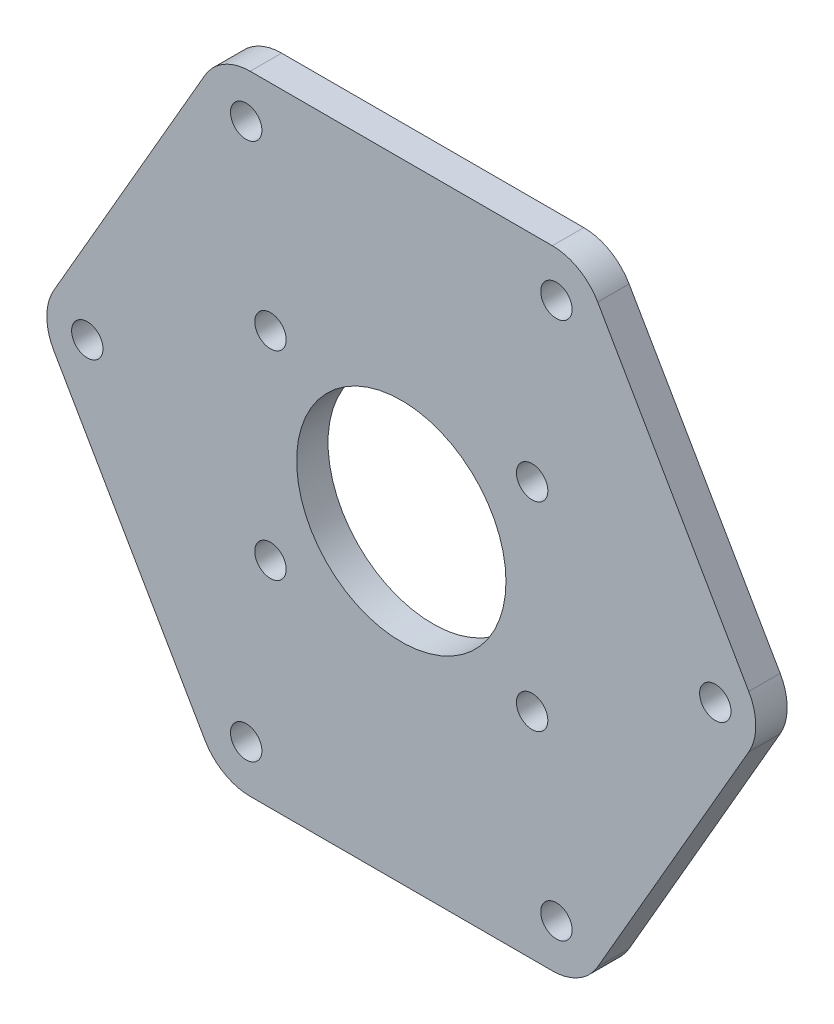
ISO-10303-21;
HEADER;
FILE_DESCRIPTION(('STEP AP214'),'2;1');
FILE_NAME('part.step','',(''),(''),'','','');
FILE_SCHEMA(('AUTOMOTIVE_DESIGN { 1 0 10303 214 1 1 1 1 }'));
ENDSEC;
DATA;
#1=APPLICATION_CONTEXT('core data for automotive mechanical design processes');
#2=APPLICATION_PROTOCOL_DEFINITION('international standard','automotive_design',2000,#1);
#3=PRODUCT_CONTEXT('',#1,'mechanical');
#4=PRODUCT('Part','Part','',(#3));
#5=PRODUCT_RELATED_PRODUCT_CATEGORY('part','',(#4));
#6=PRODUCT_DEFINITION_FORMATION('','',#4);
#7=PRODUCT_DEFINITION_CONTEXT('part definition',#1,'design');
#8=PRODUCT_DEFINITION('design','',#6,#7);
#9=PRODUCT_DEFINITION_SHAPE('','',#8);
#10=(LENGTH_UNIT() NAMED_UNIT(*) SI_UNIT(.MILLI.,.METRE.));
#11=(NAMED_UNIT(*) PLANE_ANGLE_UNIT() SI_UNIT($,.RADIAN.));
#12=(NAMED_UNIT(*) SI_UNIT($,.STERADIAN.) SOLID_ANGLE_UNIT());
#13=UNCERTAINTY_MEASURE_WITH_UNIT(LENGTH_MEASURE(1.E-05),#10,'distance_accuracy_value','');
#14=(GEOMETRIC_REPRESENTATION_CONTEXT(3) GLOBAL_UNCERTAINTY_ASSIGNED_CONTEXT((#13)) GLOBAL_UNIT_ASSIGNED_CONTEXT((#10,
#11,#12)) REPRESENTATION_CONTEXT('',''));
#15=CARTESIAN_POINT('',(0.,0.,0.));
#16=DIRECTION('',(0.,0.,1.));
#17=DIRECTION('',(1.,0.,0.));
#18=AXIS2_PLACEMENT_3D('',#15,#16,#17);
#19=CARTESIAN_POINT('',(17.3205080756888,-30.,3.));
#20=DIRECTION('',(-0.866025403784439,0.5,0.));
#21=DIRECTION('',(-0.5,-0.866025403784439,0.));
#22=AXIS2_PLACEMENT_3D('',#19,#20,#21);
#23=PLANE('',#22);
#24=DIRECTION('',(0.5,0.866025403784439,0.));
#25=VECTOR('',#24,1.);
#26=CARTESIAN_POINT('',(17.3205080756888,-30.,0.));
#27=LINE('',#26,#25);
#28=CARTESIAN_POINT('',(18.7638837486628,-27.5,0.));
#29=VERTEX_POINT('',#28);
#30=CARTESIAN_POINT('',(33.1976404784035,-2.5,0.));
#31=VERTEX_POINT('',#30);
#32=EDGE_CURVE('E152',#29,#31,#27,.T.);
#33=ORIENTED_EDGE('',*,*,#32,.T.);
#34=DIRECTION('',(0.,0.,-1.));
#35=VECTOR('',#34,1.);
#36=CARTESIAN_POINT('',(33.1976404784035,-2.49999999999999,3.));
#37=LINE('',#36,#35);
#38=CARTESIAN_POINT('',(33.1976404784035,-2.5,3.));
#39=VERTEX_POINT('',#38);
#40=EDGE_CURVE('E130',#31,#39,#37,.F.);
#41=ORIENTED_EDGE('',*,*,#40,.T.);
#42=DIRECTION('',(0.5,0.866025403784439,0.));
#43=VECTOR('',#42,1.);
#44=CARTESIAN_POINT('',(17.3205080756888,-30.,3.));
#45=LINE('',#44,#43);
#46=CARTESIAN_POINT('',(18.7638837486628,-27.5,3.));
#47=VERTEX_POINT('',#46);
#48=EDGE_CURVE('E168',#47,#39,#45,.T.);
#49=ORIENTED_EDGE('',*,*,#48,.F.);
#50=DIRECTION('',(0.,0.,-1.));
#51=VECTOR('',#50,1.);
#52=CARTESIAN_POINT('',(18.7638837486628,-27.5,3.));
#53=LINE('',#52,#51);
#54=EDGE_CURVE('E135',#47,#29,#53,.T.);
#55=ORIENTED_EDGE('',*,*,#54,.T.);
#56=EDGE_LOOP('',(#33,#41,#49,#55));
#57=FACE_BOUND('',#56,.T.);
#58=ADVANCED_FACE('F35',(#57),#23,.F.);
#59=CARTESIAN_POINT('',(34.6410161513775,0.,3.));
#60=DIRECTION('',(-0.866025403784438,-0.5,0.));
#61=DIRECTION('',(0.5,-0.866025403784439,0.));
#62=AXIS2_PLACEMENT_3D('',#59,#60,#61);
#63=PLANE('',#62);
#64=DIRECTION('',(-0.5,0.866025403784439,0.));
#65=VECTOR('',#64,1.);
#66=CARTESIAN_POINT('',(34.6410161513775,0.,3.));
#67=LINE('',#66,#65);
#68=CARTESIAN_POINT('',(33.1976404784035,2.5,3.));
#69=VERTEX_POINT('',#68);
#70=CARTESIAN_POINT('',(18.7638837486628,27.5,3.));
#71=VERTEX_POINT('',#70);
#72=EDGE_CURVE('E145',#69,#71,#67,.T.);
#73=ORIENTED_EDGE('',*,*,#72,.F.);
#74=DIRECTION('',(0.,0.,-1.));
#75=VECTOR('',#74,1.);
#76=CARTESIAN_POINT('',(33.1976404784035,2.50000000000001,3.));
#77=LINE('',#76,#75);
#78=CARTESIAN_POINT('',(33.1976404784035,2.5,0.));
#79=VERTEX_POINT('',#78);
#80=EDGE_CURVE('E129',#69,#79,#77,.T.);
#81=ORIENTED_EDGE('',*,*,#80,.T.);
#82=DIRECTION('',(-0.5,0.866025403784439,0.));
#83=VECTOR('',#82,1.);
#84=CARTESIAN_POINT('',(34.6410161513775,0.,0.));
#85=LINE('',#84,#83);
#86=CARTESIAN_POINT('',(18.7638837486628,27.5,0.));
#87=VERTEX_POINT('',#86);
#88=EDGE_CURVE('E142',#79,#87,#85,.T.);
#89=ORIENTED_EDGE('',*,*,#88,.T.);
#90=DIRECTION('',(0.,0.,-1.));
#91=VECTOR('',#90,1.);
#92=CARTESIAN_POINT('',(18.7638837486628,27.5,3.));
#93=LINE('',#92,#91);
#94=EDGE_CURVE('E147',#87,#71,#93,.F.);
#95=ORIENTED_EDGE('',*,*,#94,.T.);
#96=EDGE_LOOP('',(#73,#81,#89,#95));
#97=FACE_BOUND('',#96,.T.);
#98=ADVANCED_FACE('F141',(#97),#63,.F.);
#99=CARTESIAN_POINT('',(17.3205080756887,30.,3.));
#100=DIRECTION('',(0.,-1.,0.));
#101=DIRECTION('',(0.,0.,-1.));
#102=AXIS2_PLACEMENT_3D('',#99,#100,#101);
#103=PLANE('',#102);
#104=DIRECTION('',(-1.,0.,0.));
#105=VECTOR('',#104,1.);
#106=CARTESIAN_POINT('',(17.3205080756887,30.,3.));
#107=LINE('',#106,#105);
#108=CARTESIAN_POINT('',(14.4337567297406,30.,3.));
#109=VERTEX_POINT('',#108);
#110=CARTESIAN_POINT('',(-14.4337567297407,30.,3.));
#111=VERTEX_POINT('',#110);
#112=EDGE_CURVE('E228',#109,#111,#107,.T.);
#113=ORIENTED_EDGE('',*,*,#112,.F.);
#114=DIRECTION('',(0.,0.,-1.));
#115=VECTOR('',#114,1.);
#116=CARTESIAN_POINT('',(14.4337567297406,30.,3.));
#117=LINE('',#116,#115);
#118=CARTESIAN_POINT('',(14.4337567297406,30.,0.));
#119=VERTEX_POINT('',#118);
#120=EDGE_CURVE('E195',#109,#119,#117,.T.);
#121=ORIENTED_EDGE('',*,*,#120,.T.);
#122=DIRECTION('',(-1.,0.,0.));
#123=VECTOR('',#122,1.);
#124=CARTESIAN_POINT('',(17.3205080756887,30.,0.));
#125=LINE('',#124,#123);
#126=CARTESIAN_POINT('',(-14.4337567297407,30.,0.));
#127=VERTEX_POINT('',#126);
#128=EDGE_CURVE('E151',#119,#127,#125,.T.);
#129=ORIENTED_EDGE('',*,*,#128,.T.);
#130=DIRECTION('',(0.,0.,-1.));
#131=VECTOR('',#130,1.);
#132=CARTESIAN_POINT('',(-14.4337567297407,30.,3.));
#133=LINE('',#132,#131);
#134=EDGE_CURVE('E193',#127,#111,#133,.F.);
#135=ORIENTED_EDGE('',*,*,#134,.T.);
#136=EDGE_LOOP('',(#113,#121,#129,#135));
#137=FACE_BOUND('',#136,.T.);
#138=ADVANCED_FACE('F347',(#137),#103,.F.);
#139=CARTESIAN_POINT('',(-17.3205080756888,30.,3.));
#140=DIRECTION('',(0.866025403784439,-0.5,0.));
#141=DIRECTION('',(0.5,0.866025403784439,0.));
#142=AXIS2_PLACEMENT_3D('',#139,#140,#141);
#143=PLANE('',#142);
#144=DIRECTION('',(-0.5,-0.866025403784439,0.));
#145=VECTOR('',#144,1.);
#146=CARTESIAN_POINT('',(-17.3205080756888,30.,3.));
#147=LINE('',#146,#145);
#148=CARTESIAN_POINT('',(-18.7638837486629,27.5,3.));
#149=VERTEX_POINT('',#148);
#150=CARTESIAN_POINT('',(-33.1976404784035,2.5,3.));
#151=VERTEX_POINT('',#150);
#152=EDGE_CURVE('E223',#149,#151,#147,.T.);
#153=ORIENTED_EDGE('',*,*,#152,.F.);
#154=DIRECTION('',(0.,0.,-1.));
#155=VECTOR('',#154,1.);
#156=CARTESIAN_POINT('',(-18.7638837486629,27.5,3.));
#157=LINE('',#156,#155);
#158=CARTESIAN_POINT('',(-18.7638837486629,27.5,0.));
#159=VERTEX_POINT('',#158);
#160=EDGE_CURVE('E200',#149,#159,#157,.T.);
#161=ORIENTED_EDGE('',*,*,#160,.T.);
#162=DIRECTION('',(-0.5,-0.866025403784439,0.));
#163=VECTOR('',#162,1.);
#164=CARTESIAN_POINT('',(-17.3205080756888,30.,0.));
#165=LINE('',#164,#163);
#166=CARTESIAN_POINT('',(-33.1976404784035,2.5,0.));
#167=VERTEX_POINT('',#166);
#168=EDGE_CURVE('E155',#159,#167,#165,.T.);
#169=ORIENTED_EDGE('',*,*,#168,.T.);
#170=DIRECTION('',(0.,0.,-1.));
#171=VECTOR('',#170,1.);
#172=CARTESIAN_POINT('',(-33.1976404784035,2.5,3.));
#173=LINE('',#172,#171);
#174=EDGE_CURVE('E198',#167,#151,#173,.F.);
#175=ORIENTED_EDGE('',*,*,#174,.T.);
#176=EDGE_LOOP('',(#153,#161,#169,#175));
#177=FACE_BOUND('',#176,.T.);
#178=ADVANCED_FACE('F369',(#177),#143,.F.);
#179=CARTESIAN_POINT('',(-34.6410161513776,0.,3.));
#180=DIRECTION('',(0.866025403784438,0.5,0.));
#181=DIRECTION('',(-0.5,0.866025403784439,0.));
#182=AXIS2_PLACEMENT_3D('',#179,#180,#181);
#183=PLANE('',#182);
#184=DIRECTION('',(0.5,-0.866025403784439,0.));
#185=VECTOR('',#184,1.);
#186=CARTESIAN_POINT('',(-34.6410161513776,0.,3.));
#187=LINE('',#186,#185);
#188=CARTESIAN_POINT('',(-33.1976404784035,-2.5,3.));
#189=VERTEX_POINT('',#188);
#190=CARTESIAN_POINT('',(-18.7638837486629,-27.5,3.));
#191=VERTEX_POINT('',#190);
#192=EDGE_CURVE('E213',#189,#191,#187,.T.);
#193=ORIENTED_EDGE('',*,*,#192,.F.);
#194=DIRECTION('',(0.,0.,-1.));
#195=VECTOR('',#194,1.);
#196=CARTESIAN_POINT('',(-33.1976404784035,-2.5,3.));
#197=LINE('',#196,#195);
#198=CARTESIAN_POINT('',(-33.1976404784035,-2.5,0.));
#199=VERTEX_POINT('',#198);
#200=EDGE_CURVE('E205',#189,#199,#197,.T.);
#201=ORIENTED_EDGE('',*,*,#200,.T.);
#202=DIRECTION('',(0.5,-0.866025403784439,0.));
#203=VECTOR('',#202,1.);
#204=CARTESIAN_POINT('',(-34.6410161513776,0.,0.));
#205=LINE('',#204,#203);
#206=CARTESIAN_POINT('',(-18.7638837486629,-27.5,0.));
#207=VERTEX_POINT('',#206);
#208=EDGE_CURVE('E163',#199,#207,#205,.T.);
#209=ORIENTED_EDGE('',*,*,#208,.T.);
#210=DIRECTION('',(0.,0.,-1.));
#211=VECTOR('',#210,1.);
#212=CARTESIAN_POINT('',(-18.7638837486629,-27.5,3.));
#213=LINE('',#212,#211);
#214=EDGE_CURVE('E203',#207,#191,#213,.F.);
#215=ORIENTED_EDGE('',*,*,#214,.T.);
#216=EDGE_LOOP('',(#193,#201,#209,#215));
#217=FACE_BOUND('',#216,.T.);
#218=ADVANCED_FACE('F211',(#217),#183,.F.);
#219=CARTESIAN_POINT('',(-17.3205080756888,-30.,3.));
#220=DIRECTION('',(0.,1.,0.));
#221=DIRECTION('',(0.,0.,1.));
#222=AXIS2_PLACEMENT_3D('',#219,#220,#221);
#223=PLANE('',#222);
#224=DIRECTION('',(1.,0.,0.));
#225=VECTOR('',#224,1.);
#226=CARTESIAN_POINT('',(-17.3205080756888,-30.,3.));
#227=LINE('',#226,#225);
#228=CARTESIAN_POINT('',(-14.4337567297407,-30.,3.));
#229=VERTEX_POINT('',#228);
#230=CARTESIAN_POINT('',(14.4337567297406,-30.,3.));
#231=VERTEX_POINT('',#230);
#232=EDGE_CURVE('E169',#229,#231,#227,.T.);
#233=ORIENTED_EDGE('',*,*,#232,.F.);
#234=DIRECTION('',(0.,0.,-1.));
#235=VECTOR('',#234,1.);
#236=CARTESIAN_POINT('',(-14.4337567297407,-30.,3.));
#237=LINE('',#236,#235);
#238=CARTESIAN_POINT('',(-14.4337567297407,-30.,0.));
#239=VERTEX_POINT('',#238);
#240=EDGE_CURVE('E11',#229,#239,#237,.T.);
#241=ORIENTED_EDGE('',*,*,#240,.T.);
#242=DIRECTION('',(1.,0.,0.));
#243=VECTOR('',#242,1.);
#244=CARTESIAN_POINT('',(-17.3205080756888,-30.,0.));
#245=LINE('',#244,#243);
#246=CARTESIAN_POINT('',(14.4337567297406,-30.,0.));
#247=VERTEX_POINT('',#246);
#248=EDGE_CURVE('E166',#239,#247,#245,.T.);
#249=ORIENTED_EDGE('',*,*,#248,.T.);
#250=DIRECTION('',(0.,0.,-1.));
#251=VECTOR('',#250,1.);
#252=CARTESIAN_POINT('',(14.4337567297406,-30.,3.));
#253=LINE('',#252,#251);
#254=EDGE_CURVE('E43',#247,#231,#253,.F.);
#255=ORIENTED_EDGE('',*,*,#254,.T.);
#256=EDGE_LOOP('',(#233,#241,#249,#255));
#257=FACE_BOUND('',#256,.T.);
#258=ADVANCED_FACE('F221',(#257),#223,.F.);
#259=CARTESIAN_POINT('',(0.,0.,3.));
#260=DIRECTION('',(0.,0.,1.));
#261=DIRECTION('',(1.,0.,0.));
#262=AXIS2_PLACEMENT_3D('',#259,#260,#261);
#263=PLANE('',#262);
#264=CARTESIAN_POINT('',(-30.,0.,3.));
#265=DIRECTION('',(0.,0.,1.));
#266=DIRECTION('',(1.,0.,0.));
#267=AXIS2_PLACEMENT_3D('',#264,#265,#266);
#268=CIRCLE('',#267,1.5);
#269=CARTESIAN_POINT('',(-28.5,0.,3.));
#270=VERTEX_POINT('',#269);
#271=EDGE_CURVE('E277',#270,#270,#268,.T.);
#272=ORIENTED_EDGE('',*,*,#271,.F.);
#273=EDGE_LOOP('',(#272));
#274=FACE_BOUND('',#273,.T.);
#275=CARTESIAN_POINT('',(14.8205080756888,25.6698729810778,3.));
#276=DIRECTION('',(0.,0.,1.));
#277=DIRECTION('',(1.,0.,0.));
#278=AXIS2_PLACEMENT_3D('',#275,#276,#277);
#279=CIRCLE('',#278,1.5);
#280=CARTESIAN_POINT('',(16.3205080756888,25.6698729810778,3.));
#281=VERTEX_POINT('',#280);
#282=EDGE_CURVE('E290',#281,#281,#279,.T.);
#283=ORIENTED_EDGE('',*,*,#282,.F.);
#284=EDGE_LOOP('',(#283));
#285=FACE_BOUND('',#284,.T.);
#286=CARTESIAN_POINT('',(30.,0.,3.));
#287=DIRECTION('',(0.,0.,1.));
#288=DIRECTION('',(1.,0.,0.));
#289=AXIS2_PLACEMENT_3D('',#286,#287,#288);
#290=CIRCLE('',#289,1.5);
#291=CARTESIAN_POINT('',(31.5,0.,3.));
#292=VERTEX_POINT('',#291);
#293=EDGE_CURVE('E271',#292,#292,#290,.T.);
#294=ORIENTED_EDGE('',*,*,#293,.F.);
#295=EDGE_LOOP('',(#294));
#296=FACE_BOUND('',#295,.T.);
#297=CARTESIAN_POINT('',(-14.8205080756888,-25.6698729810778,3.));
#298=DIRECTION('',(0.,0.,1.));
#299=DIRECTION('',(1.,0.,0.));
#300=AXIS2_PLACEMENT_3D('',#297,#298,#299);
#301=CIRCLE('',#300,1.5);
#302=CARTESIAN_POINT('',(-13.3205080756888,-25.6698729810778,3.));
#303=VERTEX_POINT('',#302);
#304=EDGE_CURVE('E264',#303,#303,#301,.T.);
#305=ORIENTED_EDGE('',*,*,#304,.F.);
#306=EDGE_LOOP('',(#305));
#307=FACE_BOUND('',#306,.T.);
#308=CARTESIAN_POINT('',(14.8205080756888,-25.6698729810778,3.));
#309=DIRECTION('',(0.,0.,1.));
#310=DIRECTION('',(1.,0.,0.));
#311=AXIS2_PLACEMENT_3D('',#308,#309,#310);
#312=CIRCLE('',#311,1.5);
#313=CARTESIAN_POINT('',(16.3205080756888,-25.6698729810778,3.));
#314=VERTEX_POINT('',#313);
#315=EDGE_CURVE('E285',#314,#314,#312,.T.);
#316=ORIENTED_EDGE('',*,*,#315,.F.);
#317=EDGE_LOOP('',(#316));
#318=FACE_BOUND('',#317,.T.);
#319=CARTESIAN_POINT('',(-14.8205080756888,25.6698729810778,3.));
#320=DIRECTION('',(0.,0.,1.));
#321=DIRECTION('',(1.,0.,0.));
#322=AXIS2_PLACEMENT_3D('',#319,#320,#321);
#323=CIRCLE('',#322,1.5);
#324=CARTESIAN_POINT('',(-13.3205080756888,25.6698729810778,3.));
#325=VERTEX_POINT('',#324);
#326=EDGE_CURVE('E278',#325,#325,#323,.T.);
#327=ORIENTED_EDGE('',*,*,#326,.F.);
#328=EDGE_LOOP('',(#327));
#329=FACE_BOUND('',#328,.T.);
#330=CARTESIAN_POINT('',(12.5,-9.5,3.));
#331=DIRECTION('',(0.,0.,1.));
#332=DIRECTION('',(1.,0.,0.));
#333=AXIS2_PLACEMENT_3D('',#330,#331,#332);
#334=CIRCLE('',#333,1.5);
#335=CARTESIAN_POINT('',(14.,-9.5,3.));
#336=VERTEX_POINT('',#335);
#337=EDGE_CURVE('E240',#336,#336,#334,.T.);
#338=ORIENTED_EDGE('',*,*,#337,.F.);
#339=EDGE_LOOP('',(#338));
#340=FACE_BOUND('',#339,.T.);
#341=CARTESIAN_POINT('',(-12.5,-9.5,3.));
#342=DIRECTION('',(0.,0.,1.));
#343=DIRECTION('',(1.,0.,0.));
#344=AXIS2_PLACEMENT_3D('',#341,#342,#343);
#345=CIRCLE('',#344,1.5);
#346=CARTESIAN_POINT('',(-11.,-9.5,3.));
#347=VERTEX_POINT('',#346);
#348=EDGE_CURVE('E247',#347,#347,#345,.T.);
#349=ORIENTED_EDGE('',*,*,#348,.F.);
#350=EDGE_LOOP('',(#349));
#351=FACE_BOUND('',#350,.T.);
#352=CARTESIAN_POINT('',(12.5,9.5,3.));
#353=DIRECTION('',(0.,0.,1.));
#354=DIRECTION('',(1.,0.,0.));
#355=AXIS2_PLACEMENT_3D('',#352,#353,#354);
#356=CIRCLE('',#355,1.5);
#357=CARTESIAN_POINT('',(14.,9.5,3.));
#358=VERTEX_POINT('',#357);
#359=EDGE_CURVE('E253',#358,#358,#356,.T.);
#360=ORIENTED_EDGE('',*,*,#359,.F.);
#361=EDGE_LOOP('',(#360));
#362=FACE_BOUND('',#361,.T.);
#363=CARTESIAN_POINT('',(-12.5,9.5,3.));
#364=DIRECTION('',(0.,0.,1.));
#365=DIRECTION('',(1.,0.,0.));
#366=AXIS2_PLACEMENT_3D('',#363,#364,#365);
#367=CIRCLE('',#366,1.5);
#368=CARTESIAN_POINT('',(-11.,9.5,3.));
#369=VERTEX_POINT('',#368);
#370=EDGE_CURVE('E259',#369,#369,#367,.T.);
#371=ORIENTED_EDGE('',*,*,#370,.F.);
#372=EDGE_LOOP('',(#371));
#373=FACE_BOUND('',#372,.T.);
#374=CARTESIAN_POINT('',(0.,0.,3.));
#375=DIRECTION('',(0.,0.,1.));
#376=DIRECTION('',(1.,0.,0.));
#377=AXIS2_PLACEMENT_3D('',#374,#375,#376);
#378=CIRCLE('',#377,10.);
#379=CARTESIAN_POINT('',(10.,0.,3.));
#380=VERTEX_POINT('',#379);
#381=EDGE_CURVE('E234',#380,#380,#378,.T.);
#382=ORIENTED_EDGE('',*,*,#381,.F.);
#383=EDGE_LOOP('',(#382));
#384=FACE_BOUND('',#383,.T.);
#385=ORIENTED_EDGE('',*,*,#48,.T.);
#386=CARTESIAN_POINT('',(28.8675134594813,0.,3.));
#387=DIRECTION('',(0.,0.,1.));
#388=DIRECTION('',(1.,0.,0.));
#389=AXIS2_PLACEMENT_3D('',#386,#387,#388);
#390=CIRCLE('',#389,5.);
#391=EDGE_CURVE('E191',#39,#69,#390,.T.);
#392=ORIENTED_EDGE('',*,*,#391,.T.);
#393=ORIENTED_EDGE('',*,*,#72,.T.);
#394=CARTESIAN_POINT('',(14.4337567297406,25.,3.));
#395=DIRECTION('',(0.,0.,1.));
#396=DIRECTION('',(1.,0.,0.));
#397=AXIS2_PLACEMENT_3D('',#394,#395,#396);
#398=CIRCLE('',#397,5.);
#399=EDGE_CURVE('E189',#71,#109,#398,.T.);
#400=ORIENTED_EDGE('',*,*,#399,.T.);
#401=ORIENTED_EDGE('',*,*,#112,.T.);
#402=CARTESIAN_POINT('',(-14.4337567297407,25.,3.));
#403=DIRECTION('',(0.,0.,1.));
#404=DIRECTION('',(1.,0.,0.));
#405=AXIS2_PLACEMENT_3D('',#402,#403,#404);
#406=CIRCLE('',#405,5.);
#407=EDGE_CURVE('E187',#111,#149,#406,.T.);
#408=ORIENTED_EDGE('',*,*,#407,.T.);
#409=ORIENTED_EDGE('',*,*,#152,.T.);
#410=CARTESIAN_POINT('',(-28.8675134594813,0.,3.));
#411=DIRECTION('',(0.,0.,1.));
#412=DIRECTION('',(1.,0.,0.));
#413=AXIS2_PLACEMENT_3D('',#410,#411,#412);
#414=CIRCLE('',#413,5.);
#415=EDGE_CURVE('E185',#151,#189,#414,.T.);
#416=ORIENTED_EDGE('',*,*,#415,.T.);
#417=ORIENTED_EDGE('',*,*,#192,.T.);
#418=CARTESIAN_POINT('',(-14.4337567297407,-25.,3.));
#419=DIRECTION('',(0.,0.,1.));
#420=DIRECTION('',(1.,0.,0.));
#421=AXIS2_PLACEMENT_3D('',#418,#419,#420);
#422=CIRCLE('',#421,5.);
#423=EDGE_CURVE('E56',#191,#229,#422,.T.);
#424=ORIENTED_EDGE('',*,*,#423,.T.);
#425=ORIENTED_EDGE('',*,*,#232,.T.);
#426=CARTESIAN_POINT('',(14.4337567297406,-25.,3.));
#427=DIRECTION('',(0.,0.,1.));
#428=DIRECTION('',(1.,0.,0.));
#429=AXIS2_PLACEMENT_3D('',#426,#427,#428);
#430=CIRCLE('',#429,5.);
#431=EDGE_CURVE('E182',#231,#47,#430,.T.);
#432=ORIENTED_EDGE('',*,*,#431,.T.);
#433=EDGE_LOOP('',(#385,#392,#393,#400,#401,#408,#409,#416,#417,#424,#425,#432));
#434=FACE_BOUND('',#433,.T.);
#435=ADVANCED_FACE('F309',(#274,#285,#296,#307,#318,#329,#340,#351,#362,#373,#384,#434),#263,.T.);
#436=CARTESIAN_POINT('',(0.,0.,0.));
#437=DIRECTION('',(0.,0.,1.));
#438=DIRECTION('',(1.,0.,0.));
#439=AXIS2_PLACEMENT_3D('',#436,#437,#438);
#440=PLANE('',#439);
#441=CARTESIAN_POINT('',(-30.,0.,0.));
#442=DIRECTION('',(0.,0.,1.));
#443=DIRECTION('',(1.,0.,0.));
#444=AXIS2_PLACEMENT_3D('',#441,#442,#443);
#445=CIRCLE('',#444,1.5);
#446=CARTESIAN_POINT('',(-28.5,0.,0.));
#447=VERTEX_POINT('',#446);
#448=EDGE_CURVE('E244',#447,#447,#445,.T.);
#449=ORIENTED_EDGE('',*,*,#448,.T.);
#450=EDGE_LOOP('',(#449));
#451=FACE_BOUND('',#450,.T.);
#452=CARTESIAN_POINT('',(14.8205080756888,25.6698729810778,0.));
#453=DIRECTION('',(0.,0.,1.));
#454=DIRECTION('',(1.,0.,0.));
#455=AXIS2_PLACEMENT_3D('',#452,#453,#454);
#456=CIRCLE('',#455,1.5);
#457=CARTESIAN_POINT('',(16.3205080756888,25.6698729810778,0.));
#458=VERTEX_POINT('',#457);
#459=EDGE_CURVE('E282',#458,#458,#456,.T.);
#460=ORIENTED_EDGE('',*,*,#459,.T.);
#461=EDGE_LOOP('',(#460));
#462=FACE_BOUND('',#461,.T.);
#463=CARTESIAN_POINT('',(30.,0.,0.));
#464=DIRECTION('',(0.,0.,1.));
#465=DIRECTION('',(1.,0.,0.));
#466=AXIS2_PLACEMENT_3D('',#463,#464,#465);
#467=CIRCLE('',#466,1.5);
#468=CARTESIAN_POINT('',(31.5,0.,0.));
#469=VERTEX_POINT('',#468);
#470=EDGE_CURVE('E274',#469,#469,#467,.T.);
#471=ORIENTED_EDGE('',*,*,#470,.T.);
#472=EDGE_LOOP('',(#471));
#473=FACE_BOUND('',#472,.T.);
#474=CARTESIAN_POINT('',(-14.8205080756888,-25.6698729810778,0.));
#475=DIRECTION('',(0.,0.,1.));
#476=DIRECTION('',(1.,0.,0.));
#477=AXIS2_PLACEMENT_3D('',#474,#475,#476);
#478=CIRCLE('',#477,1.5);
#479=CARTESIAN_POINT('',(-13.3205080756888,-25.6698729810778,0.));
#480=VERTEX_POINT('',#479);
#481=EDGE_CURVE('E267',#480,#480,#478,.T.);
#482=ORIENTED_EDGE('',*,*,#481,.T.);
#483=EDGE_LOOP('',(#482));
#484=FACE_BOUND('',#483,.T.);
#485=CARTESIAN_POINT('',(14.8205080756888,-25.6698729810778,0.));
#486=DIRECTION('',(0.,0.,1.));
#487=DIRECTION('',(1.,0.,0.));
#488=AXIS2_PLACEMENT_3D('',#485,#486,#487);
#489=CIRCLE('',#488,1.5);
#490=CARTESIAN_POINT('',(16.3205080756888,-25.6698729810778,0.));
#491=VERTEX_POINT('',#490);
#492=EDGE_CURVE('E268',#491,#491,#489,.T.);
#493=ORIENTED_EDGE('',*,*,#492,.T.);
#494=EDGE_LOOP('',(#493));
#495=FACE_BOUND('',#494,.T.);
#496=CARTESIAN_POINT('',(-14.8205080756888,25.6698729810778,0.));
#497=DIRECTION('',(0.,0.,1.));
#498=DIRECTION('',(1.,0.,0.));
#499=AXIS2_PLACEMENT_3D('',#496,#497,#498);
#500=CIRCLE('',#499,1.5);
#501=CARTESIAN_POINT('',(-13.3205080756888,25.6698729810778,0.));
#502=VERTEX_POINT('',#501);
#503=EDGE_CURVE('E281',#502,#502,#500,.T.);
#504=ORIENTED_EDGE('',*,*,#503,.T.);
#505=EDGE_LOOP('',(#504));
#506=FACE_BOUND('',#505,.T.);
#507=CARTESIAN_POINT('',(12.5,-9.5,0.));
#508=DIRECTION('',(0.,0.,1.));
#509=DIRECTION('',(1.,0.,0.));
#510=AXIS2_PLACEMENT_3D('',#507,#508,#509);
#511=CIRCLE('',#510,1.5);
#512=CARTESIAN_POINT('',(14.,-9.5,0.));
#513=VERTEX_POINT('',#512);
#514=EDGE_CURVE('E243',#513,#513,#511,.T.);
#515=ORIENTED_EDGE('',*,*,#514,.T.);
#516=EDGE_LOOP('',(#515));
#517=FACE_BOUND('',#516,.T.);
#518=CARTESIAN_POINT('',(-12.5,-9.5,0.));
#519=DIRECTION('',(0.,0.,1.));
#520=DIRECTION('',(1.,0.,0.));
#521=AXIS2_PLACEMENT_3D('',#518,#519,#520);
#522=CIRCLE('',#521,1.5);
#523=CARTESIAN_POINT('',(-11.,-9.5,0.));
#524=VERTEX_POINT('',#523);
#525=EDGE_CURVE('E250',#524,#524,#522,.T.);
#526=ORIENTED_EDGE('',*,*,#525,.T.);
#527=EDGE_LOOP('',(#526));
#528=FACE_BOUND('',#527,.T.);
#529=CARTESIAN_POINT('',(12.5,9.5,0.));
#530=DIRECTION('',(0.,0.,1.));
#531=DIRECTION('',(1.,0.,0.));
#532=AXIS2_PLACEMENT_3D('',#529,#530,#531);
#533=CIRCLE('',#532,1.5);
#534=CARTESIAN_POINT('',(14.,9.5,0.));
#535=VERTEX_POINT('',#534);
#536=EDGE_CURVE('E256',#535,#535,#533,.T.);
#537=ORIENTED_EDGE('',*,*,#536,.T.);
#538=EDGE_LOOP('',(#537));
#539=FACE_BOUND('',#538,.T.);
#540=CARTESIAN_POINT('',(-12.5,9.5,0.));
#541=DIRECTION('',(0.,0.,1.));
#542=DIRECTION('',(1.,0.,0.));
#543=AXIS2_PLACEMENT_3D('',#540,#541,#542);
#544=CIRCLE('',#543,1.5);
#545=CARTESIAN_POINT('',(-11.,9.5,0.));
#546=VERTEX_POINT('',#545);
#547=EDGE_CURVE('E237',#546,#546,#544,.T.);
#548=ORIENTED_EDGE('',*,*,#547,.T.);
#549=EDGE_LOOP('',(#548));
#550=FACE_BOUND('',#549,.T.);
#551=CARTESIAN_POINT('',(0.,0.,0.));
#552=DIRECTION('',(0.,0.,1.));
#553=DIRECTION('',(1.,0.,0.));
#554=AXIS2_PLACEMENT_3D('',#551,#552,#553);
#555=CIRCLE('',#554,10.);
#556=CARTESIAN_POINT('',(10.,0.,0.));
#557=VERTEX_POINT('',#556);
#558=EDGE_CURVE('E157',#557,#557,#555,.T.);
#559=ORIENTED_EDGE('',*,*,#558,.T.);
#560=EDGE_LOOP('',(#559));
#561=FACE_BOUND('',#560,.T.);
#562=ORIENTED_EDGE('',*,*,#88,.F.);
#563=CARTESIAN_POINT('',(28.8675134594813,0.,0.));
#564=DIRECTION('',(0.,0.,1.));
#565=DIRECTION('',(1.,0.,0.));
#566=AXIS2_PLACEMENT_3D('',#563,#564,#565);
#567=CIRCLE('',#566,5.);
#568=EDGE_CURVE('E125',#79,#31,#567,.F.);
#569=ORIENTED_EDGE('',*,*,#568,.T.);
#570=ORIENTED_EDGE('',*,*,#32,.F.);
#571=CARTESIAN_POINT('',(14.4337567297406,-25.,0.));
#572=DIRECTION('',(0.,0.,1.));
#573=DIRECTION('',(1.,0.,0.));
#574=AXIS2_PLACEMENT_3D('',#571,#572,#573);
#575=CIRCLE('',#574,5.);
#576=EDGE_CURVE('E146',#29,#247,#575,.F.);
#577=ORIENTED_EDGE('',*,*,#576,.T.);
#578=ORIENTED_EDGE('',*,*,#248,.F.);
#579=CARTESIAN_POINT('',(-14.4337567297407,-25.,0.));
#580=DIRECTION('',(0.,0.,1.));
#581=DIRECTION('',(1.,0.,0.));
#582=AXIS2_PLACEMENT_3D('',#579,#580,#581);
#583=CIRCLE('',#582,5.);
#584=EDGE_CURVE('E172',#239,#207,#583,.F.);
#585=ORIENTED_EDGE('',*,*,#584,.T.);
#586=ORIENTED_EDGE('',*,*,#208,.F.);
#587=CARTESIAN_POINT('',(-28.8675134594813,0.,0.));
#588=DIRECTION('',(0.,0.,1.));
#589=DIRECTION('',(1.,0.,0.));
#590=AXIS2_PLACEMENT_3D('',#587,#588,#589);
#591=CIRCLE('',#590,5.);
#592=EDGE_CURVE('E174',#199,#167,#591,.F.);
#593=ORIENTED_EDGE('',*,*,#592,.T.);
#594=ORIENTED_EDGE('',*,*,#168,.F.);
#595=CARTESIAN_POINT('',(-14.4337567297407,25.,0.));
#596=DIRECTION('',(0.,0.,1.));
#597=DIRECTION('',(1.,0.,0.));
#598=AXIS2_PLACEMENT_3D('',#595,#596,#597);
#599=CIRCLE('',#598,5.);
#600=EDGE_CURVE('E176',#159,#127,#599,.F.);
#601=ORIENTED_EDGE('',*,*,#600,.T.);
#602=ORIENTED_EDGE('',*,*,#128,.F.);
#603=CARTESIAN_POINT('',(14.4337567297406,25.,0.));
#604=DIRECTION('',(0.,0.,1.));
#605=DIRECTION('',(1.,0.,0.));
#606=AXIS2_PLACEMENT_3D('',#603,#604,#605);
#607=CIRCLE('',#606,5.);
#608=EDGE_CURVE('E136',#119,#87,#607,.F.);
#609=ORIENTED_EDGE('',*,*,#608,.T.);
#610=EDGE_LOOP('',(#562,#569,#570,#577,#578,#585,#586,#593,#594,#601,#602,#609));
#611=FACE_BOUND('',#610,.T.);
#612=ADVANCED_FACE('F149',(#451,#462,#473,#484,#495,#506,#517,#528,#539,#550,#561,#611),#440,.F.);
#613=CARTESIAN_POINT('',(0.,0.,0.));
#614=DIRECTION('',(0.,0.,1.));
#615=DIRECTION('',(1.,0.,0.));
#616=AXIS2_PLACEMENT_3D('',#613,#614,#615);
#617=CYLINDRICAL_SURFACE('',#616,10.);
#618=ORIENTED_EDGE('',*,*,#558,.F.);
#619=EDGE_LOOP('',(#618));
#620=FACE_BOUND('',#619,.T.);
#621=ORIENTED_EDGE('',*,*,#381,.T.);
#622=EDGE_LOOP('',(#621));
#623=FACE_BOUND('',#622,.T.);
#624=ADVANCED_FACE('F386',(#620,#623),#617,.F.);
#625=CARTESIAN_POINT('',(-12.5,9.5,0.));
#626=DIRECTION('',(0.,0.,1.));
#627=DIRECTION('',(1.,0.,0.));
#628=AXIS2_PLACEMENT_3D('',#625,#626,#627);
#629=CYLINDRICAL_SURFACE('',#628,1.5);
#630=ORIENTED_EDGE('',*,*,#547,.F.);
#631=EDGE_LOOP('',(#630));
#632=FACE_BOUND('',#631,.T.);
#633=ORIENTED_EDGE('',*,*,#370,.T.);
#634=EDGE_LOOP('',(#633));
#635=FACE_BOUND('',#634,.T.);
#636=ADVANCED_FACE('F390',(#632,#635),#629,.F.);
#637=CARTESIAN_POINT('',(12.5,9.5,0.));
#638=DIRECTION('',(0.,0.,1.));
#639=DIRECTION('',(1.,0.,0.));
#640=AXIS2_PLACEMENT_3D('',#637,#638,#639);
#641=CYLINDRICAL_SURFACE('',#640,1.5);
#642=ORIENTED_EDGE('',*,*,#536,.F.);
#643=EDGE_LOOP('',(#642));
#644=FACE_BOUND('',#643,.T.);
#645=ORIENTED_EDGE('',*,*,#359,.T.);
#646=EDGE_LOOP('',(#645));
#647=FACE_BOUND('',#646,.T.);
#648=ADVANCED_FACE('F400',(#644,#647),#641,.F.);
#649=CARTESIAN_POINT('',(-12.5,-9.5,0.));
#650=DIRECTION('',(0.,0.,1.));
#651=DIRECTION('',(1.,0.,0.));
#652=AXIS2_PLACEMENT_3D('',#649,#650,#651);
#653=CYLINDRICAL_SURFACE('',#652,1.5);
#654=ORIENTED_EDGE('',*,*,#525,.F.);
#655=EDGE_LOOP('',(#654));
#656=FACE_BOUND('',#655,.T.);
#657=ORIENTED_EDGE('',*,*,#348,.T.);
#658=EDGE_LOOP('',(#657));
#659=FACE_BOUND('',#658,.T.);
#660=ADVANCED_FACE('F396',(#656,#659),#653,.F.);
#661=CARTESIAN_POINT('',(12.5,-9.5,0.));
#662=DIRECTION('',(0.,0.,1.));
#663=DIRECTION('',(1.,0.,0.));
#664=AXIS2_PLACEMENT_3D('',#661,#662,#663);
#665=CYLINDRICAL_SURFACE('',#664,1.5);
#666=ORIENTED_EDGE('',*,*,#514,.F.);
#667=EDGE_LOOP('',(#666));
#668=FACE_BOUND('',#667,.T.);
#669=ORIENTED_EDGE('',*,*,#337,.T.);
#670=EDGE_LOOP('',(#669));
#671=FACE_BOUND('',#670,.T.);
#672=ADVANCED_FACE('F392',(#668,#671),#665,.F.);
#673=CARTESIAN_POINT('',(-14.8205080756888,25.6698729810778,0.));
#674=DIRECTION('',(0.,0.,1.));
#675=DIRECTION('',(1.,0.,0.));
#676=AXIS2_PLACEMENT_3D('',#673,#674,#675);
#677=CYLINDRICAL_SURFACE('',#676,1.5);
#678=ORIENTED_EDGE('',*,*,#503,.F.);
#679=EDGE_LOOP('',(#678));
#680=FACE_BOUND('',#679,.T.);
#681=ORIENTED_EDGE('',*,*,#326,.T.);
#682=EDGE_LOOP('',(#681));
#683=FACE_BOUND('',#682,.T.);
#684=ADVANCED_FACE('F395',(#680,#683),#677,.F.);
#685=CARTESIAN_POINT('',(14.8205080756888,-25.6698729810778,0.));
#686=DIRECTION('',(0.,0.,1.));
#687=DIRECTION('',(1.,0.,0.));
#688=AXIS2_PLACEMENT_3D('',#685,#686,#687);
#689=CYLINDRICAL_SURFACE('',#688,1.5);
#690=ORIENTED_EDGE('',*,*,#492,.F.);
#691=EDGE_LOOP('',(#690));
#692=FACE_BOUND('',#691,.T.);
#693=ORIENTED_EDGE('',*,*,#315,.T.);
#694=EDGE_LOOP('',(#693));
#695=FACE_BOUND('',#694,.T.);
#696=ADVANCED_FACE('F412',(#692,#695),#689,.F.);
#697=CARTESIAN_POINT('',(-14.8205080756888,-25.6698729810778,0.));
#698=DIRECTION('',(0.,0.,1.));
#699=DIRECTION('',(1.,0.,0.));
#700=AXIS2_PLACEMENT_3D('',#697,#698,#699);
#701=CYLINDRICAL_SURFACE('',#700,1.5);
#702=ORIENTED_EDGE('',*,*,#481,.F.);
#703=EDGE_LOOP('',(#702));
#704=FACE_BOUND('',#703,.T.);
#705=ORIENTED_EDGE('',*,*,#304,.T.);
#706=EDGE_LOOP('',(#705));
#707=FACE_BOUND('',#706,.T.);
#708=ADVANCED_FACE('F408',(#704,#707),#701,.F.);
#709=CARTESIAN_POINT('',(30.,0.,0.));
#710=DIRECTION('',(0.,0.,1.));
#711=DIRECTION('',(1.,0.,0.));
#712=AXIS2_PLACEMENT_3D('',#709,#710,#711);
#713=CYLINDRICAL_SURFACE('',#712,1.5);
#714=ORIENTED_EDGE('',*,*,#470,.F.);
#715=EDGE_LOOP('',(#714));
#716=FACE_BOUND('',#715,.T.);
#717=ORIENTED_EDGE('',*,*,#293,.T.);
#718=EDGE_LOOP('',(#717));
#719=FACE_BOUND('',#718,.T.);
#720=ADVANCED_FACE('F411',(#716,#719),#713,.F.);
#721=CARTESIAN_POINT('',(14.8205080756888,25.6698729810778,0.));
#722=DIRECTION('',(0.,0.,1.));
#723=DIRECTION('',(1.,0.,0.));
#724=AXIS2_PLACEMENT_3D('',#721,#722,#723);
#725=CYLINDRICAL_SURFACE('',#724,1.5);
#726=ORIENTED_EDGE('',*,*,#459,.F.);
#727=EDGE_LOOP('',(#726));
#728=FACE_BOUND('',#727,.T.);
#729=ORIENTED_EDGE('',*,*,#282,.T.);
#730=EDGE_LOOP('',(#729));
#731=FACE_BOUND('',#730,.T.);
#732=ADVANCED_FACE('F305',(#728,#731),#725,.F.);
#733=CARTESIAN_POINT('',(-30.,0.,0.));
#734=DIRECTION('',(0.,0.,1.));
#735=DIRECTION('',(1.,0.,0.));
#736=AXIS2_PLACEMENT_3D('',#733,#734,#735);
#737=CYLINDRICAL_SURFACE('',#736,1.5);
#738=ORIENTED_EDGE('',*,*,#448,.F.);
#739=EDGE_LOOP('',(#738));
#740=FACE_BOUND('',#739,.T.);
#741=ORIENTED_EDGE('',*,*,#271,.T.);
#742=EDGE_LOOP('',(#741));
#743=FACE_BOUND('',#742,.T.);
#744=ADVANCED_FACE('F302',(#740,#743),#737,.F.);
#745=CARTESIAN_POINT('',(28.8675134594813,0.,3.));
#746=DIRECTION('',(0.,0.,-1.));
#747=DIRECTION('',(-1.,0.,0.));
#748=AXIS2_PLACEMENT_3D('',#745,#746,#747);
#749=CYLINDRICAL_SURFACE('',#748,5.);
#750=ORIENTED_EDGE('',*,*,#391,.F.);
#751=ORIENTED_EDGE('',*,*,#40,.F.);
#752=ORIENTED_EDGE('',*,*,#568,.F.);
#753=ORIENTED_EDGE('',*,*,#80,.F.);
#754=EDGE_LOOP('',(#750,#751,#752,#753));
#755=FACE_BOUND('',#754,.T.);
#756=ADVANCED_FACE('F128',(#755),#749,.T.);
#757=CARTESIAN_POINT('',(14.4337567297406,25.,3.));
#758=DIRECTION('',(0.,0.,-1.));
#759=DIRECTION('',(-1.,0.,0.));
#760=AXIS2_PLACEMENT_3D('',#757,#758,#759);
#761=CYLINDRICAL_SURFACE('',#760,5.);
#762=ORIENTED_EDGE('',*,*,#399,.F.);
#763=ORIENTED_EDGE('',*,*,#94,.F.);
#764=ORIENTED_EDGE('',*,*,#608,.F.);
#765=ORIENTED_EDGE('',*,*,#120,.F.);
#766=EDGE_LOOP('',(#762,#763,#764,#765));
#767=FACE_BOUND('',#766,.T.);
#768=ADVANCED_FACE('F353',(#767),#761,.T.);
#769=CARTESIAN_POINT('',(-14.4337567297407,25.,3.));
#770=DIRECTION('',(0.,0.,-1.));
#771=DIRECTION('',(-1.,0.,0.));
#772=AXIS2_PLACEMENT_3D('',#769,#770,#771);
#773=CYLINDRICAL_SURFACE('',#772,5.);
#774=ORIENTED_EDGE('',*,*,#407,.F.);
#775=ORIENTED_EDGE('',*,*,#134,.F.);
#776=ORIENTED_EDGE('',*,*,#600,.F.);
#777=ORIENTED_EDGE('',*,*,#160,.F.);
#778=EDGE_LOOP('',(#774,#775,#776,#777));
#779=FACE_BOUND('',#778,.T.);
#780=ADVANCED_FACE('F356',(#779),#773,.T.);
#781=CARTESIAN_POINT('',(-28.8675134594813,0.,3.));
#782=DIRECTION('',(0.,0.,-1.));
#783=DIRECTION('',(-1.,0.,0.));
#784=AXIS2_PLACEMENT_3D('',#781,#782,#783);
#785=CYLINDRICAL_SURFACE('',#784,5.);
#786=ORIENTED_EDGE('',*,*,#415,.F.);
#787=ORIENTED_EDGE('',*,*,#174,.F.);
#788=ORIENTED_EDGE('',*,*,#592,.F.);
#789=ORIENTED_EDGE('',*,*,#200,.F.);
#790=EDGE_LOOP('',(#786,#787,#788,#789));
#791=FACE_BOUND('',#790,.T.);
#792=ADVANCED_FACE('F340',(#791),#785,.T.);
#793=CARTESIAN_POINT('',(-14.4337567297407,-25.,3.));
#794=DIRECTION('',(0.,0.,-1.));
#795=DIRECTION('',(-1.,0.,0.));
#796=AXIS2_PLACEMENT_3D('',#793,#794,#795);
#797=CYLINDRICAL_SURFACE('',#796,5.);
#798=ORIENTED_EDGE('',*,*,#423,.F.);
#799=ORIENTED_EDGE('',*,*,#214,.F.);
#800=ORIENTED_EDGE('',*,*,#584,.F.);
#801=ORIENTED_EDGE('',*,*,#240,.F.);
#802=EDGE_LOOP('',(#798,#799,#800,#801));
#803=FACE_BOUND('',#802,.T.);
#804=ADVANCED_FACE('F220',(#803),#797,.T.);
#805=CARTESIAN_POINT('',(14.4337567297406,-25.,3.));
#806=DIRECTION('',(0.,0.,-1.));
#807=DIRECTION('',(-1.,0.,0.));
#808=AXIS2_PLACEMENT_3D('',#805,#806,#807);
#809=CYLINDRICAL_SURFACE('',#808,5.);
#810=ORIENTED_EDGE('',*,*,#431,.F.);
#811=ORIENTED_EDGE('',*,*,#254,.F.);
#812=ORIENTED_EDGE('',*,*,#576,.F.);
#813=ORIENTED_EDGE('',*,*,#54,.F.);
#814=EDGE_LOOP('',(#810,#811,#812,#813));
#815=FACE_BOUND('',#814,.T.);
#816=ADVANCED_FACE('F37',(#815),#809,.T.);
#817=CLOSED_SHELL('',(#58,#98,#138,#178,#218,#258,#435,#612,#624,#636,#648,#660,#672,#684,#696,
#708,#720,#732,#744,#756,#768,#780,#792,#804,#816));
#818=MANIFOLD_SOLID_BREP('B2',#817);
#819=ADVANCED_BREP_SHAPE_REPRESENTATION('',(#18,#818),#14);
#820=SHAPE_DEFINITION_REPRESENTATION(#9,#819);
ENDSEC;
END-ISO-10303-21;
